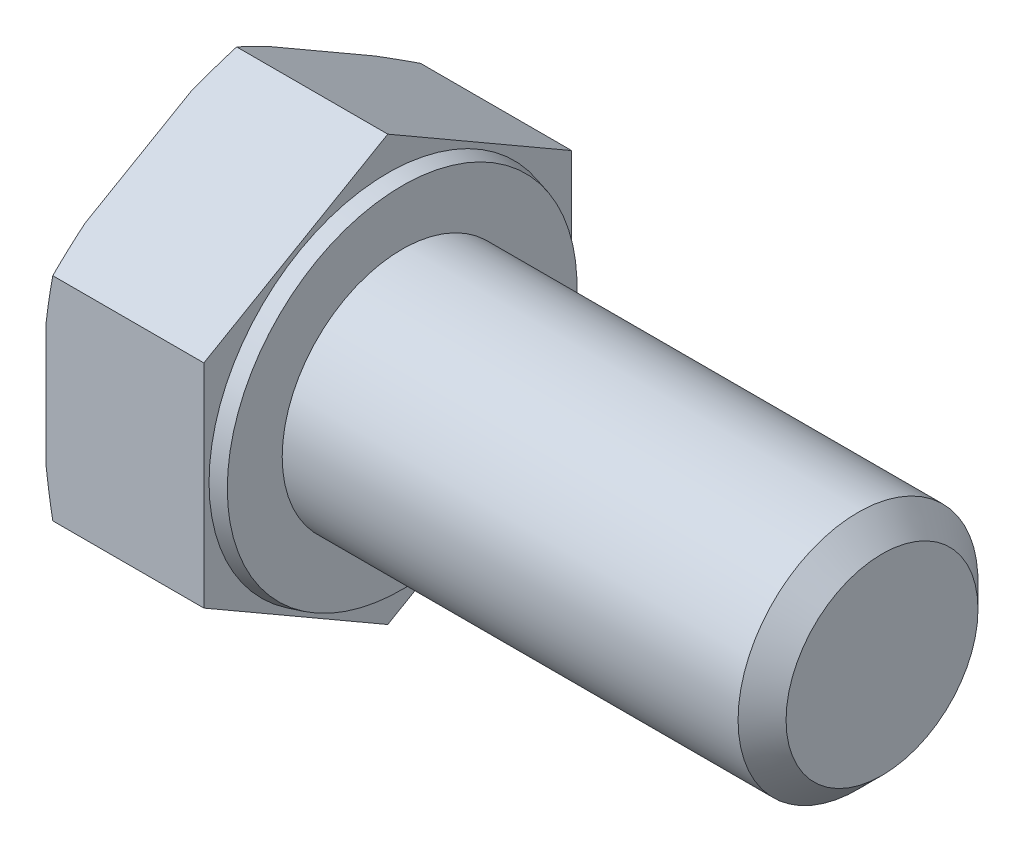
ISO-10303-21;
HEADER;
FILE_DESCRIPTION(('STEP AP214'),'2;1');
FILE_NAME('part.step','',(''),(''),'','','');
FILE_SCHEMA(('AUTOMOTIVE_DESIGN { 1 0 10303 214 1 1 1 1 }'));
ENDSEC;
DATA;
#1=APPLICATION_CONTEXT('core data for automotive mechanical design processes');
#2=APPLICATION_PROTOCOL_DEFINITION('international standard','automotive_design',2000,#1);
#3=PRODUCT_CONTEXT('',#1,'mechanical');
#4=PRODUCT('Part','Part','',(#3));
#5=PRODUCT_RELATED_PRODUCT_CATEGORY('part','',(#4));
#6=PRODUCT_DEFINITION_FORMATION('','',#4);
#7=PRODUCT_DEFINITION_CONTEXT('part definition',#1,'design');
#8=PRODUCT_DEFINITION('design','',#6,#7);
#9=PRODUCT_DEFINITION_SHAPE('','',#8);
#10=(LENGTH_UNIT() NAMED_UNIT(*) SI_UNIT(.MILLI.,.METRE.));
#11=(NAMED_UNIT(*) PLANE_ANGLE_UNIT() SI_UNIT($,.RADIAN.));
#12=(NAMED_UNIT(*) SI_UNIT($,.STERADIAN.) SOLID_ANGLE_UNIT());
#13=UNCERTAINTY_MEASURE_WITH_UNIT(LENGTH_MEASURE(1.E-05),#10,'distance_accuracy_value','');
#14=(GEOMETRIC_REPRESENTATION_CONTEXT(3) GLOBAL_UNCERTAINTY_ASSIGNED_CONTEXT((#13)) GLOBAL_UNIT_ASSIGNED_CONTEXT((#10,
#11,#12)) REPRESENTATION_CONTEXT('',''));
#15=CARTESIAN_POINT('',(0.,0.,0.));
#16=DIRECTION('',(0.,0.,1.));
#17=DIRECTION('',(1.,0.,0.));
#18=AXIS2_PLACEMENT_3D('',#15,#16,#17);
#19=CARTESIAN_POINT('',(20.6,-4.42500000000009,-7.66432482349223));
#20=DIRECTION('',(0.,-0.866025403784442,-0.499999999999995));
#21=DIRECTION('',(0.,0.499999999999995,-0.866025403784442));
#22=AXIS2_PLACEMENT_3D('',#19,#20,#21);
#23=PLANE('',#22);
#24=DIRECTION('',(-1.,0.,0.));
#25=VECTOR('',#24,1.);
#26=CARTESIAN_POINT('',(20.6,-8.85,0.));
#27=LINE('',#26,#25);
#28=CARTESIAN_POINT('',(0.,-8.85,0.));
#29=VERTEX_POINT('',#28);
#30=CARTESIAN_POINT('',(-6.29792306844368,-8.85,0.));
#31=VERTEX_POINT('',#30);
#32=EDGE_CURVE('E157',#29,#31,#27,.T.);
#33=ORIENTED_EDGE('',*,*,#32,.T.);
#34=CARTESIAN_POINT('',(-4.7699615006699,-11.9174022332107,5.3128965151713));
#35=CARTESIAN_POINT('',(-4.83614833570257,-11.8050473190038,5.11829209528478));
#36=CARTESIAN_POINT('',(-4.90167255003095,-11.6925948603644,4.92351872348535));
#37=CARTESIAN_POINT('',(-5.03118559698242,-11.4674663528304,4.53358471020429));
#38=CARTESIAN_POINT('',(-5.09517439305191,-11.3547902986816,4.33842405962226));
#39=CARTESIAN_POINT('',(-5.28456041407139,-11.0163157536771,3.75216895060563));
#40=CARTESIAN_POINT('',(-5.40733223857273,-10.7901468045144,3.3604328395613));
#41=CARTESIAN_POINT('',(-5.64480594732521,-10.3342684187143,2.57082831328319));
#42=CARTESIAN_POINT('',(-5.75941225873481,-10.1045464495324,2.17293819104533));
#43=CARTESIAN_POINT('',(-5.97591685440881,-9.6436033227612,1.37456127607789));
#44=CARTESIAN_POINT('',(-6.07781581130404,-9.41238224520544,0.974074621970502));
#45=CARTESIAN_POINT('',(-6.26134144326315,-8.95638364479248,0.184261877874947));
#46=CARTESIAN_POINT('',(-6.34355573274743,-8.73166601658844,-0.204960471530833));
#47=CARTESIAN_POINT('',(-6.48746045966098,-8.28055127837509,-0.986314118159496));
#48=CARTESIAN_POINT('',(-6.54915189984519,-8.05415425097466,-1.37844527229962));
#49=CARTESIAN_POINT('',(-6.62254434564547,-7.71410474496151,-1.9674282938031));
#50=CARTESIAN_POINT('',(-6.64378861584913,-7.60095958105454,-2.16340146632069));
#51=CARTESIAN_POINT('',(-6.67950592063896,-7.37440457175731,-2.55580625313273));
#52=CARTESIAN_POINT('',(-6.69397933196105,-7.26099474144627,-2.75223784130922));
#53=CARTESIAN_POINT('',(-6.7157765759338,-7.03401139991638,-3.14538452131075));
#54=CARTESIAN_POINT('',(-6.72310096885371,-6.92043790222291,-3.34209958970915));
#55=CARTESIAN_POINT('',(-6.73040192529392,-6.69323186195545,-3.73563199523894));
#56=CARTESIAN_POINT('',(-6.73037853713207,-6.57959931977464,-3.93244933168933));
#57=CARTESIAN_POINT('',(-6.72320871548941,-6.35929562962563,-4.31402651612232));
#58=CARTESIAN_POINT('',(-6.71649505277964,-6.25262090601261,-4.49879255730344));
#59=CARTESIAN_POINT('',(-6.69675463432834,-6.03941600442701,-4.86807427927243));
#60=CARTESIAN_POINT('',(-6.68372760236287,-5.93288583298343,-5.05258994875173));
#61=CARTESIAN_POINT('',(-6.63559663675346,-5.61363013252953,-5.60555704254389));
#62=CARTESIAN_POINT('',(-6.59144268713134,-5.40123548697151,-5.97343535990597));
#63=CARTESIAN_POINT('',(-6.48226269320506,-4.97681311893132,-6.70855646522027));
#64=CARTESIAN_POINT('',(-6.41713860156276,-4.7647919199632,-7.07578795411474));
#65=CARTESIAN_POINT('',(-6.27018625376656,-4.34222339340586,-7.80769811179158));
#66=CARTESIAN_POINT('',(-6.18835790112246,-4.1316760743376,-8.17237676581522));
#67=CARTESIAN_POINT('',(-6.00866271800198,-3.70472589760515,-8.91187616421634));
#68=CARTESIAN_POINT('',(-5.91033992742069,-3.48837165185492,-9.286612710289));
#69=CARTESIAN_POINT('',(-5.70311989656312,-3.05693413716248,-10.0338844060276));
#70=CARTESIAN_POINT('',(-5.59422212603359,-2.84185093252738,-10.4064194443103));
#71=CARTESIAN_POINT('',(-5.36943684134144,-2.41473283183158,-11.1462096955477));
#72=CARTESIAN_POINT('',(-5.25362330968472,-2.2026881429877,-11.5134818701005));
#73=CARTESIAN_POINT('',(-5.07537550670142,-1.88529185166037,-12.0632283728134));
#74=CARTESIAN_POINT('',(-5.01521325258259,-1.77961882394802,-12.2462594258008));
#75=CARTESIAN_POINT('',(-4.89354912869936,-1.56846779942573,-12.6119837283436));
#76=CARTESIAN_POINT('',(-4.83204728425027,-1.462989798971,-12.794676984212));
#77=CARTESIAN_POINT('',(-4.7699615006699,-1.35759776678936,-12.9772213386635));
#78=B_SPLINE_CURVE_WITH_KNOTS('',3,(#34,#35,#36,#37,#38,#39,#40,#41,#42,#43,#44,#45,#46,#47,#48,
#49,#50,#51,#52,#53,#54,#55,#56,#57,#58,#59,#60,#61,#62,#63,#64,#65,#66,#67,#68,#69,#70,#71,#72,
#73,#74,#75,#76,#77),.UNSPECIFIED.,.F.,.F.,(4,2,2,2,2,2,2,2,2,2,2,2,2,2,2,2,2,2,2,2,2,4),(0.,
0.702761730342381,1.40554017472233,2.81157217612387,4.23201032618944,5.65237325710521,
7.02270828812482,8.39297635416767,9.07474696516834,9.75647963740092,10.438158877887,
11.119833635759,11.7601005309412,12.4003954417532,13.6809617128842,14.9676044823533,
16.2542546841745,17.5852978857349,18.9164078632869,20.2352036230902,20.894426976119,
21.553637882061),.UNSPECIFIED.);
#79=CARTESIAN_POINT('',(-6.58000000000003,-7.90869530364146,-1.63038755949604));
#80=VERTEX_POINT('',#79);
#81=EDGE_CURVE('E202',#31,#80,#78,.T.);
#82=ORIENTED_EDGE('',*,*,#81,.T.);
#83=DIRECTION('',(0.,-0.499999999999995,0.866025403784442));
#84=VECTOR('',#83,1.);
#85=CARTESIAN_POINT('',(-6.58,-4.42500000000009,-7.66432482349223));
#86=LINE('',#85,#84);
#87=CARTESIAN_POINT('',(-6.58,-5.36630469635854,-6.03393726399618));
#88=VERTEX_POINT('',#87);
#89=EDGE_CURVE('E212',#88,#80,#86,.T.);
#90=ORIENTED_EDGE('',*,*,#89,.F.);
#91=CARTESIAN_POINT('',(-6.29792306844368,-4.42500000000009,-7.66432482349223));
#92=VERTEX_POINT('',#91);
#93=EDGE_CURVE('E215',#88,#92,#78,.T.);
#94=ORIENTED_EDGE('',*,*,#93,.T.);
#95=DIRECTION('',(-1.,0.,0.));
#96=VECTOR('',#95,1.);
#97=CARTESIAN_POINT('',(20.6,-4.42500000000009,-7.66432482349223));
#98=LINE('',#97,#96);
#99=CARTESIAN_POINT('',(0.,-4.42500000000009,-7.66432482349223));
#100=VERTEX_POINT('',#99);
#101=EDGE_CURVE('E168',#100,#92,#98,.T.);
#102=ORIENTED_EDGE('',*,*,#101,.F.);
#103=DIRECTION('',(0.,-0.499999999999995,0.866025403784442));
#104=VECTOR('',#103,1.);
#105=CARTESIAN_POINT('',(0.,-4.42500000000009,-7.66432482349223));
#106=LINE('',#105,#104);
#107=EDGE_CURVE('E183',#100,#29,#106,.T.);
#108=ORIENTED_EDGE('',*,*,#107,.T.);
#109=EDGE_LOOP('',(#33,#82,#90,#94,#102,#108));
#110=FACE_BOUND('',#109,.T.);
#111=ADVANCED_FACE('F35',(#110),#23,.T.);
#112=CARTESIAN_POINT('',(20.6,4.42499999999993,-7.66432482349232));
#113=DIRECTION('',(0.,0.,-1.));
#114=DIRECTION('',(0.,1.,0.));
#115=AXIS2_PLACEMENT_3D('',#112,#113,#114);
#116=PLANE('',#115);
#117=ORIENTED_EDGE('',*,*,#101,.T.);
#118=CARTESIAN_POINT('',(-5.00864005639831,-9.73789651517145,-7.66432482349217));
#119=CARTESIAN_POINT('',(-5.07003318744064,-9.52322769233334,-7.66432482349218));
#120=CARTESIAN_POINT('',(-5.13071664914256,-9.30835600664128,-7.66432482349218));
#121=CARTESIAN_POINT('',(-5.2504442425723,-8.87815277711283,-7.66432482349218));
#122=CARTESIAN_POINT('',(-5.30948834652955,-8.66282122555281,-7.66432482349219));
#123=CARTESIAN_POINT('',(-5.48387527888684,-8.01589307910885,-7.66432482349219));
#124=CARTESIAN_POINT('',(-5.59642298983084,-7.58353558067021,-7.6643248234922));
#125=CARTESIAN_POINT('',(-5.81266226723173,-6.71259000391773,-7.66432482349221));
#126=CARTESIAN_POINT('',(-5.91626806915323,-6.27398046842187,-7.66432482349221));
#127=CARTESIAN_POINT('',(-6.11029091280608,-5.39384656433909,-7.66432482349222));
#128=CARTESIAN_POINT('',(-6.20070892550878,-4.95232241284974,-7.66432482349222));
#129=CARTESIAN_POINT('',(-6.36160933963008,-4.08051166755351,-7.66432482349223));
#130=CARTESIAN_POINT('',(-6.43264625776086,-3.65032885049375,-7.66432482349224));
#131=CARTESIAN_POINT('',(-6.55428187483288,-2.78707107422335,-7.66432482349225));
#132=CARTESIAN_POINT('',(-6.60488453148917,-2.35399669158535,-7.66432482349225));
#133=CARTESIAN_POINT('',(-6.66240831794471,-1.70368188145931,-7.66432482349226));
#134=CARTESIAN_POINT('',(-6.67850532779577,-1.48723464984804,-7.66432482349226));
#135=CARTESIAN_POINT('',(-6.70429433272965,-1.05396299728827,-7.66432482349227));
#136=CARTESIAN_POINT('',(-6.71398664875919,-0.837138595786226,-7.66432482349227));
#137=CARTESIAN_POINT('',(-6.72672253024382,-0.403302294793051,-7.66432482349227));
#138=CARTESIAN_POINT('',(-6.72976638437883,-0.186290403852155,-7.66432482349227));
#139=CARTESIAN_POINT('',(-6.7291358967764,0.247718950123678,-7.66432482349228));
#140=CARTESIAN_POINT('',(-6.72546155695146,0.464716413162706,-7.66432482349228));
#141=CARTESIAN_POINT('',(-6.70624362970486,1.06036953223341,-7.66432482349229));
#142=CARTESIAN_POINT('',(-6.68388895075078,1.43882252598365,-7.66432482349229));
#143=CARTESIAN_POINT('',(-6.62050559151052,2.19412494594648,-7.6643248234923));
#144=CARTESIAN_POINT('',(-6.57947609181733,2.57097430106276,-7.6643248234923));
#145=CARTESIAN_POINT('',(-6.48113797206862,3.32388976987407,-7.66432482349231));
#146=CARTESIAN_POINT('',(-6.4237712185853,3.69994816672772,-7.66432482349232));
#147=CARTESIAN_POINT('',(-6.2956564145037,4.44978573942378,-7.66432482349232));
#148=CARTESIAN_POINT('',(-6.22490691200718,4.82356466341955,-7.66432482349233));
#149=CARTESIAN_POINT('',(-6.0704014797458,5.58003633732887,-7.66432482349234));
#150=CARTESIAN_POINT('',(-5.98632024183774,5.96266195818458,-7.66432482349234));
#151=CARTESIAN_POINT('',(-5.80919867667365,6.72583533235177,-7.66432482349235));
#152=CARTESIAN_POINT('',(-5.71615790531566,7.10638298167437,-7.66432482349235));
#153=CARTESIAN_POINT('',(-5.52374117974904,7.86297645537245,-7.66432482349236));
#154=CARTESIAN_POINT('',(-5.42441511026811,8.23903503370974,-7.66432482349236));
#155=CARTESIAN_POINT('',(-5.27134102225385,8.80195695976291,-7.66432482349237));
#156=CARTESIAN_POINT('',(-5.21964171692946,8.98938164843282,-7.66432482349237));
#157=CARTESIAN_POINT('',(-5.11502150400523,9.36388780999383,-7.66432482349237));
#158=CARTESIAN_POINT('',(-5.06210060924165,9.55096928646908,-7.66432482349238));
#159=CARTESIAN_POINT('',(-5.00864005639831,9.73789651517129,-7.66432482349238));
#160=B_SPLINE_CURVE_WITH_KNOTS('',3,(#118,#119,#120,#121,#122,#123,#124,#125,#126,#127,#128,
#129,#130,#131,#132,#133,#134,#135,#136,#137,#138,#139,#140,#141,#142,#143,#144,#145,#146,#147,
#148,#149,#150,#151,#152,#153,#154,#155,#156,#157,#158,#159),.UNSPECIFIED.,.F.,.F.,(4,2,2,2,2,2,
2,2,2,2,2,2,2,2,2,2,2,2,2,2,4),(0.,0.669823290546161,1.33965792092904,2.67986595636369,
4.03175825312792,5.38355096443301,6.69120700403605,7.99860965473741,8.64966414612008,
9.300686009923,9.95167960543101,10.6026730156168,11.7394565125237,12.876289893615,
14.0172201663474,15.1582742899967,16.3334026116279,17.5085892114817,18.6753990362947,
19.2586689197893,19.8419326771629),.UNSPECIFIED.);
#161=CARTESIAN_POINT('',(-6.58000000000003,-2.54239060728318,-7.66432482349217));
#162=VERTEX_POINT('',#161);
#163=EDGE_CURVE('E223',#92,#162,#160,.T.);
#164=ORIENTED_EDGE('',*,*,#163,.T.);
#165=DIRECTION('',(0.,-1.,0.));
#166=VECTOR('',#165,1.);
#167=CARTESIAN_POINT('',(-6.58,4.42499999999993,-7.66432482349232));
#168=LINE('',#167,#166);
#169=CARTESIAN_POINT('',(-6.58,2.54239060728305,-7.6643248234923));
#170=VERTEX_POINT('',#169);
#171=EDGE_CURVE('E163',#170,#162,#168,.T.);
#172=ORIENTED_EDGE('',*,*,#171,.F.);
#173=CARTESIAN_POINT('',(-6.29792306844368,4.42499999999993,-7.66432482349232));
#174=VERTEX_POINT('',#173);
#175=EDGE_CURVE('E50',#170,#174,#160,.T.);
#176=ORIENTED_EDGE('',*,*,#175,.T.);
#177=DIRECTION('',(-1.,0.,0.));
#178=VECTOR('',#177,1.);
#179=CARTESIAN_POINT('',(20.6,4.42499999999993,-7.66432482349232));
#180=LINE('',#179,#178);
#181=CARTESIAN_POINT('',(0.,4.42499999999993,-7.66432482349232));
#182=VERTEX_POINT('',#181);
#183=EDGE_CURVE('E154',#182,#174,#180,.T.);
#184=ORIENTED_EDGE('',*,*,#183,.F.);
#185=DIRECTION('',(0.,-1.,0.));
#186=VECTOR('',#185,1.);
#187=CARTESIAN_POINT('',(0.,8.84999999999992,-7.66432482349237));
#188=LINE('',#187,#186);
#189=EDGE_CURVE('E181',#182,#100,#188,.T.);
#190=ORIENTED_EDGE('',*,*,#189,.T.);
#191=EDGE_LOOP('',(#117,#164,#172,#176,#184,#190));
#192=FACE_BOUND('',#191,.T.);
#193=ADVANCED_FACE('F250',(#192),#116,.T.);
#194=CARTESIAN_POINT('',(20.6,8.85,0.));
#195=DIRECTION('',(0.,0.866025403784435,-0.500000000000007));
#196=DIRECTION('',(0.,0.500000000000007,0.866025403784435));
#197=AXIS2_PLACEMENT_3D('',#194,#195,#196);
#198=PLANE('',#197);
#199=ORIENTED_EDGE('',*,*,#183,.T.);
#200=CARTESIAN_POINT('',(-4.76996150066986,1.35759776678906,-12.9772213386637));
#201=CARTESIAN_POINT('',(-4.83614833570253,1.46995268099604,-12.7826169187772));
#202=CARTESIAN_POINT('',(-4.9016725500309,1.58240513963541,-12.5878435469777));
#203=CARTESIAN_POINT('',(-5.03118559698238,1.80753364716942,-12.1979095336967));
#204=CARTESIAN_POINT('',(-5.09517439305187,1.92020970131818,-12.0027488831146));
#205=CARTESIAN_POINT('',(-5.28456041407135,2.25868424632273,-11.416493774098));
#206=CARTESIAN_POINT('',(-5.40733223857269,2.48485319548548,-11.0247576630537));
#207=CARTESIAN_POINT('',(-5.64480594732517,2.94073158128551,-10.2351531367756));
#208=CARTESIAN_POINT('',(-5.75941225873478,3.17045355046743,-9.83726301453771));
#209=CARTESIAN_POINT('',(-5.97591685440879,3.63139667723867,-9.03888609957028));
#210=CARTESIAN_POINT('',(-6.07781581130402,3.86261775479443,-8.63839944546289));
#211=CARTESIAN_POINT('',(-6.26134144326313,4.3186163552074,-7.84858670136733));
#212=CARTESIAN_POINT('',(-6.34355573274742,4.54333398341145,-7.45936435196155));
#213=CARTESIAN_POINT('',(-6.48746045966097,4.99444872162482,-6.67801070533289));
#214=CARTESIAN_POINT('',(-6.54915189984519,5.22084574902526,-6.28587955119277));
#215=CARTESIAN_POINT('',(-6.62254434564547,5.56089525503842,-5.69689652968929));
#216=CARTESIAN_POINT('',(-6.64378861584913,5.6740404189454,-5.5009233571717));
#217=CARTESIAN_POINT('',(-6.67950592063896,5.90059542824263,-5.10851857035966));
#218=CARTESIAN_POINT('',(-6.69397933196106,6.01400525855368,-4.91208698218316));
#219=CARTESIAN_POINT('',(-6.7157765759338,6.24098860008357,-4.51894030218163));
#220=CARTESIAN_POINT('',(-6.72310096885372,6.35456209777704,-4.32222523378324));
#221=CARTESIAN_POINT('',(-6.73040192529394,6.58176813804451,-3.92869282825345));
#222=CARTESIAN_POINT('',(-6.73037853713208,6.69540068022533,-3.73187549180306));
#223=CARTESIAN_POINT('',(-6.72320871548943,6.91570437037435,-3.35029830737006));
#224=CARTESIAN_POINT('',(-6.71649505277966,7.02237909398738,-3.16553226618893));
#225=CARTESIAN_POINT('',(-6.69675463432836,7.23558399557298,-2.79625054421994));
#226=CARTESIAN_POINT('',(-6.68372760236289,7.34211416701656,-2.61173487474064));
#227=CARTESIAN_POINT('',(-6.63559663675348,7.66136986747048,-2.05876778094847));
#228=CARTESIAN_POINT('',(-6.59144268713136,7.87376451302852,-1.69088946358639));
#229=CARTESIAN_POINT('',(-6.48226269320508,8.29818688106872,-0.955768358272066));
#230=CARTESIAN_POINT('',(-6.41713860156277,8.51020808003686,-0.588536869377594));
#231=CARTESIAN_POINT('',(-6.27018625376657,8.93277660659422,0.143373288299261));
#232=CARTESIAN_POINT('',(-6.18835790112246,9.14332392566248,0.508051942322905));
#233=CARTESIAN_POINT('',(-6.00866271800198,9.57027410239495,1.24755134072404));
#234=CARTESIAN_POINT('',(-5.91033992742068,9.7866283481452,1.62228788679671));
#235=CARTESIAN_POINT('',(-5.7031198965631,10.2180658628377,2.36955958253527));
#236=CARTESIAN_POINT('',(-5.59422212603357,10.4331490674728,2.74209462081801));
#237=CARTESIAN_POINT('',(-5.36943684134141,10.8602671681686,3.48188487205548));
#238=CARTESIAN_POINT('',(-5.25362330968469,11.0723118570125,3.84915704660822));
#239=CARTESIAN_POINT('',(-5.07537550670138,11.3897081483398,4.39890354932111));
#240=CARTESIAN_POINT('',(-5.01521325258256,11.4953811760522,4.58193460230855));
#241=CARTESIAN_POINT('',(-4.89354912869932,11.7065322005745,4.94765890485139));
#242=CARTESIAN_POINT('',(-4.83204728425022,11.8120102010292,5.13035216071975));
#243=CARTESIAN_POINT('',(-4.76996150066986,11.9174022332109,5.3128965151713));
#244=B_SPLINE_CURVE_WITH_KNOTS('',3,(#200,#201,#202,#203,#204,#205,#206,#207,#208,#209,#210,
#211,#212,#213,#214,#215,#216,#217,#218,#219,#220,#221,#222,#223,#224,#225,#226,#227,#228,#229,
#230,#231,#232,#233,#234,#235,#236,#237,#238,#239,#240,#241,#242,#243),.UNSPECIFIED.,.F.,.F.,(4,
2,2,2,2,2,2,2,2,2,2,2,2,2,2,2,2,2,2,2,2,4),(0.,0.702761730342386,1.40554017472235,
2.8115721761239,4.23201032618948,5.65237325710526,7.02270828812488,8.39297635416775,
9.07474696516843,9.75647963740101,10.4381588778871,11.1198336357591,11.7601005309413,
12.4003954417533,13.6809617128843,14.9676044823535,16.2542546841748,17.5852978857351,
18.9164078632872,20.2352036230905,20.8944269761194,21.5536378820613),.UNSPECIFIED.);
#245=CARTESIAN_POINT('',(-6.58000000000003,5.36630469635833,-6.03393726399625));
#246=VERTEX_POINT('',#245);
#247=EDGE_CURVE('E245',#174,#246,#244,.T.);
#248=ORIENTED_EDGE('',*,*,#247,.T.);
#249=DIRECTION('',(0.,-0.500000000000007,-0.866025403784435));
#250=VECTOR('',#249,1.);
#251=CARTESIAN_POINT('',(-6.58,8.85,0.));
#252=LINE('',#251,#250);
#253=CARTESIAN_POINT('',(-6.58,7.90869530364155,-1.63038755949607));
#254=VERTEX_POINT('',#253);
#255=EDGE_CURVE('E235',#254,#246,#252,.T.);
#256=ORIENTED_EDGE('',*,*,#255,.F.);
#257=CARTESIAN_POINT('',(-6.29792306844368,8.85,0.));
#258=VERTEX_POINT('',#257);
#259=EDGE_CURVE('E58',#254,#258,#244,.T.);
#260=ORIENTED_EDGE('',*,*,#259,.T.);
#261=DIRECTION('',(-1.,0.,0.));
#262=VECTOR('',#261,1.);
#263=CARTESIAN_POINT('',(20.6,8.85,0.));
#264=LINE('',#263,#262);
#265=CARTESIAN_POINT('',(0.,8.85,0.));
#266=VERTEX_POINT('',#265);
#267=EDGE_CURVE('E151',#266,#258,#264,.T.);
#268=ORIENTED_EDGE('',*,*,#267,.F.);
#269=DIRECTION('',(0.,-0.500000000000007,-0.866025403784435));
#270=VECTOR('',#269,1.);
#271=CARTESIAN_POINT('',(0.,8.85000000000003,0.));
#272=LINE('',#271,#270);
#273=EDGE_CURVE('E179',#266,#182,#272,.T.);
#274=ORIENTED_EDGE('',*,*,#273,.T.);
#275=EDGE_LOOP('',(#199,#248,#256,#260,#268,#274));
#276=FACE_BOUND('',#275,.T.);
#277=ADVANCED_FACE('F243',(#276),#198,.T.);
#278=CARTESIAN_POINT('',(20.6,4.42500000000004,7.66432482349226));
#279=DIRECTION('',(0.,0.866025403784442,0.499999999999995));
#280=DIRECTION('',(0.,-0.499999999999995,0.866025403784442));
#281=AXIS2_PLACEMENT_3D('',#278,#279,#280);
#282=PLANE('',#281);
#283=ORIENTED_EDGE('',*,*,#267,.T.);
#284=CARTESIAN_POINT('',(-4.76996150066987,11.9174022332108,-5.31289651517142));
#285=CARTESIAN_POINT('',(-4.83614833570254,11.8050473190038,-5.1182920952849));
#286=CARTESIAN_POINT('',(-4.90167255003092,11.6925948603644,-4.92351872348547));
#287=CARTESIAN_POINT('',(-5.03118559698239,11.4674663528304,-4.53358471020441));
#288=CARTESIAN_POINT('',(-5.09517439305188,11.3547902986817,-4.33842405962238));
#289=CARTESIAN_POINT('',(-5.28456041407136,11.0163157536771,-3.75216895060575));
#290=CARTESIAN_POINT('',(-5.40733223857271,10.7901468045144,-3.36043283956141));
#291=CARTESIAN_POINT('',(-5.64480594732519,10.3342684187144,-2.57082831328329));
#292=CARTESIAN_POINT('',(-5.75941225873479,10.1045464495324,-2.17293819104543));
#293=CARTESIAN_POINT('',(-5.9759168544088,9.64360332276122,-1.374561276078));
#294=CARTESIAN_POINT('',(-6.07781581130403,9.41238224520547,-0.974074621970603));
#295=CARTESIAN_POINT('',(-6.26134144326314,8.9563836447925,-0.184261877875044));
#296=CARTESIAN_POINT('',(-6.34355573274742,8.73166601658846,0.204960471530738));
#297=CARTESIAN_POINT('',(-6.48746045966097,8.28055127837511,0.986314118159405));
#298=CARTESIAN_POINT('',(-6.54915189984519,8.05415425097468,1.37844527229953));
#299=CARTESIAN_POINT('',(-6.62254434564547,7.71410474496152,1.96742829380302));
#300=CARTESIAN_POINT('',(-6.64378861584914,7.60095958105455,2.16340146632061));
#301=CARTESIAN_POINT('',(-6.67950592063896,7.37440457175732,2.55580625313265));
#302=CARTESIAN_POINT('',(-6.69397933196106,7.26099474144628,2.75223784130914));
#303=CARTESIAN_POINT('',(-6.7157765759338,7.03401139991639,3.14538452131068));
#304=CARTESIAN_POINT('',(-6.72310096885372,6.92043790222292,3.34209958970907));
#305=CARTESIAN_POINT('',(-6.73040192529394,6.69323186195546,3.73563199523886));
#306=CARTESIAN_POINT('',(-6.73037853713208,6.57959931977464,3.93244933168925));
#307=CARTESIAN_POINT('',(-6.72320871548943,6.35929562962563,4.31402651612225));
#308=CARTESIAN_POINT('',(-6.71649505277965,6.25262090601261,4.49879255730338));
#309=CARTESIAN_POINT('',(-6.69675463432836,6.03941600442701,4.86807427927237));
#310=CARTESIAN_POINT('',(-6.68372760236289,5.93288583298343,5.05258994875167));
#311=CARTESIAN_POINT('',(-6.63559663675348,5.61363013252952,5.60555704254384));
#312=CARTESIAN_POINT('',(-6.59144268713136,5.40123548697149,5.97343535990593));
#313=CARTESIAN_POINT('',(-6.48226269320508,4.9768131189313,6.70855646522025));
#314=CARTESIAN_POINT('',(-6.41713860156277,4.76479191996317,7.07578795411472));
#315=CARTESIAN_POINT('',(-6.27018625376657,4.34222339340582,7.80769811179158));
#316=CARTESIAN_POINT('',(-6.18835790112247,4.13167607433756,8.17237676581522));
#317=CARTESIAN_POINT('',(-6.00866271800198,3.70472589760511,8.91187616421636));
#318=CARTESIAN_POINT('',(-5.91033992742068,3.48837165185487,9.28661271028903));
#319=CARTESIAN_POINT('',(-5.70311989656311,3.05693413716242,10.0338844060276));
#320=CARTESIAN_POINT('',(-5.59422212603358,2.84185093252732,10.4064194443103));
#321=CARTESIAN_POINT('',(-5.36943684134142,2.41473283183151,11.1462096955478));
#322=CARTESIAN_POINT('',(-5.2536233096847,2.20268814298763,11.5134818701005));
#323=CARTESIAN_POINT('',(-5.07537550670139,1.88529185166029,12.0632283728134));
#324=CARTESIAN_POINT('',(-5.01521325258257,1.77961882394793,12.2462594258009));
#325=CARTESIAN_POINT('',(-4.89354912869933,1.56846779942564,12.6119837283437));
#326=CARTESIAN_POINT('',(-4.83204728425023,1.46298979897091,12.7946769842121));
#327=CARTESIAN_POINT('',(-4.76996150066987,1.35759776678926,12.9772213386636));
#328=B_SPLINE_CURVE_WITH_KNOTS('',3,(#284,#285,#286,#287,#288,#289,#290,#291,#292,#293,#294,
#295,#296,#297,#298,#299,#300,#301,#302,#303,#304,#305,#306,#307,#308,#309,#310,#311,#312,#313,
#314,#315,#316,#317,#318,#319,#320,#321,#322,#323,#324,#325,#326,#327),.UNSPECIFIED.,.F.,.F.,(4,
2,2,2,2,2,2,2,2,2,2,2,2,2,2,2,2,2,2,2,2,4),(0.,0.702761730342387,1.40554017472234,
2.81157217612389,4.23201032618947,5.65237325710524,7.02270828812486,8.39297635416772,
9.0747469651684,9.75647963740098,10.4381588778871,11.119833635759,11.7601005309412,
12.4003954417533,13.6809617128843,14.9676044823535,16.2542546841747,17.5852978857351,
18.9164078632871,20.2352036230904,20.8944269761193,21.5536378820613),.UNSPECIFIED.);
#329=CARTESIAN_POINT('',(-6.58000000000003,7.90869530364148,1.63038755949594));
#330=VERTEX_POINT('',#329);
#331=EDGE_CURVE('E145',#258,#330,#328,.T.);
#332=ORIENTED_EDGE('',*,*,#331,.T.);
#333=DIRECTION('',(0.,0.499999999999995,-0.866025403784442));
#334=VECTOR('',#333,1.);
#335=CARTESIAN_POINT('',(-6.58,4.42500000000004,7.66432482349226));
#336=LINE('',#335,#334);
#337=CARTESIAN_POINT('',(-6.58,5.36630469635847,6.03393726399624));
#338=VERTEX_POINT('',#337);
#339=EDGE_CURVE('E144',#338,#330,#336,.T.);
#340=ORIENTED_EDGE('',*,*,#339,.F.);
#341=CARTESIAN_POINT('',(-6.29792306844368,4.42500000000004,7.66432482349226));
#342=VERTEX_POINT('',#341);
#343=EDGE_CURVE('E126',#338,#342,#328,.T.);
#344=ORIENTED_EDGE('',*,*,#343,.T.);
#345=DIRECTION('',(-1.,0.,0.));
#346=VECTOR('',#345,1.);
#347=CARTESIAN_POINT('',(20.6,4.42500000000004,7.66432482349226));
#348=LINE('',#347,#346);
#349=CARTESIAN_POINT('',(0.,4.42500000000004,7.66432482349226));
#350=VERTEX_POINT('',#349);
#351=EDGE_CURVE('E140',#350,#342,#348,.T.);
#352=ORIENTED_EDGE('',*,*,#351,.F.);
#353=DIRECTION('',(0.,0.499999999999995,-0.866025403784442));
#354=VECTOR('',#353,1.);
#355=CARTESIAN_POINT('',(0.,8.84999999999997,0.));
#356=LINE('',#355,#354);
#357=EDGE_CURVE('E177',#350,#266,#356,.T.);
#358=ORIENTED_EDGE('',*,*,#357,.T.);
#359=EDGE_LOOP('',(#283,#332,#340,#344,#352,#358));
#360=FACE_BOUND('',#359,.T.);
#361=ADVANCED_FACE('F139',(#360),#282,.T.);
#362=CARTESIAN_POINT('',(20.6,-4.42499999999998,7.66432482349229));
#363=DIRECTION('',(0.,0.,1.));
#364=DIRECTION('',(0.,-1.,0.));
#365=AXIS2_PLACEMENT_3D('',#362,#363,#364);
#366=PLANE('',#365);
#367=ORIENTED_EDGE('',*,*,#351,.T.);
#368=CARTESIAN_POINT('',(-5.00864005639831,9.7378965151714,7.66432482349224));
#369=CARTESIAN_POINT('',(-5.07003318744064,9.52322769233328,7.66432482349224));
#370=CARTESIAN_POINT('',(-5.13071664914256,9.30835600664122,7.66432482349224));
#371=CARTESIAN_POINT('',(-5.2504442425723,8.87815277711278,7.66432482349225));
#372=CARTESIAN_POINT('',(-5.30948834652955,8.66282122555276,7.66432482349225));
#373=CARTESIAN_POINT('',(-5.48387527888684,8.0158930791088,7.66432482349225));
#374=CARTESIAN_POINT('',(-5.59642298983084,7.58353558067016,7.66432482349225));
#375=CARTESIAN_POINT('',(-5.81266226723173,6.71259000391768,7.66432482349225));
#376=CARTESIAN_POINT('',(-5.91626806915323,6.27398046842182,7.66432482349225));
#377=CARTESIAN_POINT('',(-6.11029091280608,5.39384656433903,7.66432482349226));
#378=CARTESIAN_POINT('',(-6.20070892550878,4.95232241284969,7.66432482349226));
#379=CARTESIAN_POINT('',(-6.36160933963008,4.08051166755345,7.66432482349226));
#380=CARTESIAN_POINT('',(-6.43264625776087,3.6503288504937,7.66432482349226));
#381=CARTESIAN_POINT('',(-6.55428187483288,2.7870710742233,7.66432482349227));
#382=CARTESIAN_POINT('',(-6.60488453148917,2.3539966915853,7.66432482349227));
#383=CARTESIAN_POINT('',(-6.66240831794471,1.70368188145926,7.66432482349227));
#384=CARTESIAN_POINT('',(-6.67850532779577,1.48723464984798,7.66432482349227));
#385=CARTESIAN_POINT('',(-6.70429433272965,1.05396299728821,7.66432482349227));
#386=CARTESIAN_POINT('',(-6.71398664875919,0.83713859578617,7.66432482349227));
#387=CARTESIAN_POINT('',(-6.72672253024382,0.403302294792995,7.66432482349227));
#388=CARTESIAN_POINT('',(-6.72976638437883,0.1862904038521,7.66432482349228));
#389=CARTESIAN_POINT('',(-6.7291358967764,-0.247718950123733,7.66432482349228));
#390=CARTESIAN_POINT('',(-6.72546155695146,-0.46471641316276,7.66432482349228));
#391=CARTESIAN_POINT('',(-6.70624362970486,-1.06036953223346,7.66432482349228));
#392=CARTESIAN_POINT('',(-6.68388895075078,-1.43882252598371,7.66432482349228));
#393=CARTESIAN_POINT('',(-6.62050559151052,-2.19412494594653,7.66432482349228));
#394=CARTESIAN_POINT('',(-6.57947609181733,-2.57097430106281,7.66432482349229));
#395=CARTESIAN_POINT('',(-6.48113797206862,-3.32388976987413,7.66432482349229));
#396=CARTESIAN_POINT('',(-6.4237712185853,-3.69994816672777,7.66432482349229));
#397=CARTESIAN_POINT('',(-6.2956564145037,-4.44978573942384,7.66432482349229));
#398=CARTESIAN_POINT('',(-6.22490691200718,-4.8235646634196,7.66432482349229));
#399=CARTESIAN_POINT('',(-6.0704014797458,-5.58003633732892,7.6643248234923));
#400=CARTESIAN_POINT('',(-5.98632024183774,-5.96266195818463,7.6643248234923));
#401=CARTESIAN_POINT('',(-5.80919867667365,-6.72583533235183,7.6643248234923));
#402=CARTESIAN_POINT('',(-5.71615790531566,-7.10638298167442,7.6643248234923));
#403=CARTESIAN_POINT('',(-5.52374117974904,-7.8629764553725,7.66432482349231));
#404=CARTESIAN_POINT('',(-5.42441511026811,-8.2390350337098,7.66432482349231));
#405=CARTESIAN_POINT('',(-5.27134102225385,-8.80195695976297,7.66432482349231));
#406=CARTESIAN_POINT('',(-5.21964171692946,-8.98938164843288,7.66432482349231));
#407=CARTESIAN_POINT('',(-5.11502150400523,-9.36388780999389,7.66432482349231));
#408=CARTESIAN_POINT('',(-5.06210060924165,-9.55096928646914,7.66432482349231));
#409=CARTESIAN_POINT('',(-5.00864005639831,-9.73789651517135,7.66432482349231));
#410=B_SPLINE_CURVE_WITH_KNOTS('',3,(#368,#369,#370,#371,#372,#373,#374,#375,#376,#377,#378,
#379,#380,#381,#382,#383,#384,#385,#386,#387,#388,#389,#390,#391,#392,#393,#394,#395,#396,#397,
#398,#399,#400,#401,#402,#403,#404,#405,#406,#407,#408,#409),.UNSPECIFIED.,.F.,.F.,(4,2,2,2,2,2,
2,2,2,2,2,2,2,2,2,2,2,2,2,2,4),(0.,0.669823290546161,1.33965792092904,2.67986595636369,
4.03175825312792,5.38355096443301,6.69120700403605,7.99860965473742,8.64966414612009,
9.300686009923,9.95167960543102,10.6026730156168,11.7394565125237,12.876289893615,
14.0172201663474,15.1582742899967,16.3334026116279,17.5085892114817,18.6753990362947,
19.2586689197893,19.8419326771629),.UNSPECIFIED.);
#411=CARTESIAN_POINT('',(-6.58000000000003,2.54239060728313,7.66432482349219));
#412=VERTEX_POINT('',#411);
#413=EDGE_CURVE('E123',#342,#412,#410,.T.);
#414=ORIENTED_EDGE('',*,*,#413,.T.);
#415=DIRECTION('',(0.,1.,0.));
#416=VECTOR('',#415,1.);
#417=CARTESIAN_POINT('',(-6.58,-4.42499999999998,7.66432482349229));
#418=LINE('',#417,#416);
#419=CARTESIAN_POINT('',(-6.58,-2.5423906072831,7.66432482349229));
#420=VERTEX_POINT('',#419);
#421=EDGE_CURVE('E221',#420,#412,#418,.T.);
#422=ORIENTED_EDGE('',*,*,#421,.F.);
#423=CARTESIAN_POINT('',(-6.29792306844368,-4.42499999999998,7.66432482349229));
#424=VERTEX_POINT('',#423);
#425=EDGE_CURVE('E133',#420,#424,#410,.T.);
#426=ORIENTED_EDGE('',*,*,#425,.T.);
#427=DIRECTION('',(-1.,0.,0.));
#428=VECTOR('',#427,1.);
#429=CARTESIAN_POINT('',(20.6,-4.42499999999998,7.66432482349229));
#430=LINE('',#429,#428);
#431=CARTESIAN_POINT('',(0.,-4.42499999999998,7.66432482349229));
#432=VERTEX_POINT('',#431);
#433=EDGE_CURVE('E152',#432,#424,#430,.T.);
#434=ORIENTED_EDGE('',*,*,#433,.F.);
#435=DIRECTION('',(0.,1.,0.));
#436=VECTOR('',#435,1.);
#437=CARTESIAN_POINT('',(0.,8.85000000000003,7.66432482349225));
#438=LINE('',#437,#436);
#439=EDGE_CURVE('E150',#432,#350,#438,.T.);
#440=ORIENTED_EDGE('',*,*,#439,.T.);
#441=EDGE_LOOP('',(#367,#414,#422,#426,#434,#440));
#442=FACE_BOUND('',#441,.T.);
#443=ADVANCED_FACE('F147',(#442),#366,.T.);
#444=CARTESIAN_POINT('',(20.6,-8.85,0.));
#445=DIRECTION('',(0.,-0.866025403784438,0.500000000000001));
#446=DIRECTION('',(0.,-0.500000000000001,-0.866025403784438));
#447=AXIS2_PLACEMENT_3D('',#444,#445,#446);
#448=PLANE('',#447);
#449=ORIENTED_EDGE('',*,*,#433,.T.);
#450=CARTESIAN_POINT('',(-4.76996150066987,-1.35759776678916,12.9772213386637));
#451=CARTESIAN_POINT('',(-4.83614833570253,-1.46995268099614,12.7826169187771));
#452=CARTESIAN_POINT('',(-4.90167255003091,-1.58240513963551,12.5878435469777));
#453=CARTESIAN_POINT('',(-5.03118559698239,-1.80753364716952,12.1979095336966));
#454=CARTESIAN_POINT('',(-5.09517439305187,-1.92020970131828,12.0027488831146));
#455=CARTESIAN_POINT('',(-5.28456041407135,-2.25868424632282,11.416493774098));
#456=CARTESIAN_POINT('',(-5.4073322385727,-2.48485319548557,11.0247576630537));
#457=CARTESIAN_POINT('',(-5.64480594732518,-2.94073158128559,10.2351531367755));
#458=CARTESIAN_POINT('',(-5.75941225873479,-3.17045355046751,9.83726301453767));
#459=CARTESIAN_POINT('',(-5.97591685440879,-3.63139667723874,9.03888609957024));
#460=CARTESIAN_POINT('',(-6.07781581130402,-3.8626177547945,8.63839944546285));
#461=CARTESIAN_POINT('',(-6.26134144326314,-4.31861635520747,7.84858670136729));
#462=CARTESIAN_POINT('',(-6.34355573274742,-4.54333398341151,7.45936435196151));
#463=CARTESIAN_POINT('',(-6.48746045966097,-4.99444872162487,6.67801070533285));
#464=CARTESIAN_POINT('',(-6.54915189984519,-5.22084574902531,6.28587955119272));
#465=CARTESIAN_POINT('',(-6.62254434564547,-5.56089525503846,5.69689652968924));
#466=CARTESIAN_POINT('',(-6.64378861584913,-5.67404041894544,5.50092335717165));
#467=CARTESIAN_POINT('',(-6.67950592063896,-5.90059542824267,5.10851857035961));
#468=CARTESIAN_POINT('',(-6.69397933196106,-6.01400525855372,4.91208698218311));
#469=CARTESIAN_POINT('',(-6.7157765759338,-6.24098860008361,4.51894030218158));
#470=CARTESIAN_POINT('',(-6.72310096885372,-6.35456209777708,4.32222523378318));
#471=CARTESIAN_POINT('',(-6.73040192529394,-6.58176813804454,3.92869282825339));
#472=CARTESIAN_POINT('',(-6.73037853713208,-6.69540068022536,3.73187549180301));
#473=CARTESIAN_POINT('',(-6.72320871548943,-6.91570437037438,3.35029830737));
#474=CARTESIAN_POINT('',(-6.71649505277966,-7.0223790939874,3.16553226618888));
#475=CARTESIAN_POINT('',(-6.69675463432836,-7.23558399557301,2.79625054421989));
#476=CARTESIAN_POINT('',(-6.68372760236289,-7.34211416701659,2.61173487474059));
#477=CARTESIAN_POINT('',(-6.63559663675348,-7.6613698674705,2.05876778094842));
#478=CARTESIAN_POINT('',(-6.59144268713136,-7.87376451302853,1.69088946358633));
#479=CARTESIAN_POINT('',(-6.48226269320508,-8.29818688106873,0.955768358272009));
#480=CARTESIAN_POINT('',(-6.41713860156277,-8.51020808003686,0.588536869377536));
#481=CARTESIAN_POINT('',(-6.27018625376657,-8.93277660659422,-0.14337328829932));
#482=CARTESIAN_POINT('',(-6.18835790112247,-9.14332392566248,-0.508051942322964));
#483=CARTESIAN_POINT('',(-6.00866271800198,-9.57027410239494,-1.2475513407241));
#484=CARTESIAN_POINT('',(-5.91033992742068,-9.78662834814519,-1.62228788679677));
#485=CARTESIAN_POINT('',(-5.7031198965631,-10.2180658628376,-2.36955958253534));
#486=CARTESIAN_POINT('',(-5.59422212603357,-10.4331490674727,-2.74209462081808));
#487=CARTESIAN_POINT('',(-5.36943684134142,-10.8602671681686,-3.48188487205554));
#488=CARTESIAN_POINT('',(-5.25362330968469,-11.0723118570124,-3.84915704660829));
#489=CARTESIAN_POINT('',(-5.07537550670139,-11.3897081483398,-4.39890354932117));
#490=CARTESIAN_POINT('',(-5.01521325258256,-11.4953811760521,-4.58193460230861));
#491=CARTESIAN_POINT('',(-4.89354912869932,-11.7065322005744,-4.94765890485145));
#492=CARTESIAN_POINT('',(-4.83204728425023,-11.8120102010292,-5.13035216071981));
#493=CARTESIAN_POINT('',(-4.76996150066987,-11.9174022332108,-5.31289651517136));
#494=B_SPLINE_CURVE_WITH_KNOTS('',3,(#450,#451,#452,#453,#454,#455,#456,#457,#458,#459,#460,
#461,#462,#463,#464,#465,#466,#467,#468,#469,#470,#471,#472,#473,#474,#475,#476,#477,#478,#479,
#480,#481,#482,#483,#484,#485,#486,#487,#488,#489,#490,#491,#492,#493),.UNSPECIFIED.,.F.,.F.,(4,
2,2,2,2,2,2,2,2,2,2,2,2,2,2,2,2,2,2,2,2,4),(0.,0.702761730342388,1.40554017472235,
2.81157217612389,4.23201032618948,5.65237325710525,7.02270828812487,8.39297635416773,
9.07474696516841,9.756479637401,10.4381588778871,11.1198336357591,11.7601005309413,
12.4003954417533,13.6809617128843,14.9676044823535,16.2542546841747,17.5852978857351,
18.9164078632871,20.2352036230905,20.8944269761193,21.5536378820613),.UNSPECIFIED.);
#495=CARTESIAN_POINT('',(-6.58000000000003,-5.36630469635837,6.03393726399621));
#496=VERTEX_POINT('',#495);
#497=EDGE_CURVE('E213',#424,#496,#494,.T.);
#498=ORIENTED_EDGE('',*,*,#497,.T.);
#499=DIRECTION('',(0.,0.500000000000001,0.866025403784438));
#500=VECTOR('',#499,1.);
#501=CARTESIAN_POINT('',(-6.58,-8.85,0.));
#502=LINE('',#501,#500);
#503=CARTESIAN_POINT('',(-6.58,-7.90869530364156,1.63038755949602));
#504=VERTEX_POINT('',#503);
#505=EDGE_CURVE('E219',#504,#496,#502,.T.);
#506=ORIENTED_EDGE('',*,*,#505,.F.);
#507=EDGE_CURVE('E204',#504,#31,#494,.T.);
#508=ORIENTED_EDGE('',*,*,#507,.T.);
#509=ORIENTED_EDGE('',*,*,#32,.F.);
#510=DIRECTION('',(0.,0.500000000000001,0.866025403784438));
#511=VECTOR('',#510,1.);
#512=CARTESIAN_POINT('',(0.,-4.42499999999998,7.66432482349229));
#513=LINE('',#512,#511);
#514=EDGE_CURVE('E174',#29,#432,#513,.T.);
#515=ORIENTED_EDGE('',*,*,#514,.T.);
#516=EDGE_LOOP('',(#449,#498,#506,#508,#509,#515));
#517=FACE_BOUND('',#516,.T.);
#518=ADVANCED_FACE('F271',(#517),#448,.T.);
#519=CARTESIAN_POINT('',(-6.58,0.,0.));
#520=DIRECTION('',(1.,0.,0.));
#521=DIRECTION('',(0.,0.,-1.));
#522=AXIS2_PLACEMENT_3D('',#519,#520,#521);
#523=PLANE('',#522);
#524=CARTESIAN_POINT('',(-6.58,0.,0.));
#525=DIRECTION('',(1.,0.,0.));
#526=DIRECTION('',(0.,0.,-1.));
#527=AXIS2_PLACEMENT_3D('',#524,#525,#526);
#528=CIRCLE('',#527,8.07500000000009);
#529=EDGE_CURVE('E188',#170,#246,#528,.T.);
#530=ORIENTED_EDGE('',*,*,#529,.F.);
#531=ORIENTED_EDGE('',*,*,#171,.T.);
#532=EDGE_CURVE('E186',#88,#162,#528,.T.);
#533=ORIENTED_EDGE('',*,*,#532,.F.);
#534=ORIENTED_EDGE('',*,*,#89,.T.);
#535=EDGE_CURVE('E187',#504,#80,#528,.T.);
#536=ORIENTED_EDGE('',*,*,#535,.F.);
#537=ORIENTED_EDGE('',*,*,#505,.T.);
#538=EDGE_CURVE('E194',#420,#496,#528,.T.);
#539=ORIENTED_EDGE('',*,*,#538,.F.);
#540=ORIENTED_EDGE('',*,*,#421,.T.);
#541=CARTESIAN_POINT('',(-6.58000000000003,0.,0.));
#542=DIRECTION('',(-1.,0.,0.));
#543=DIRECTION('',(0.,0.,1.));
#544=AXIS2_PLACEMENT_3D('',#541,#542,#543);
#545=CIRCLE('',#544,8.075);
#546=EDGE_CURVE('E128',#412,#338,#545,.T.);
#547=ORIENTED_EDGE('',*,*,#546,.T.);
#548=ORIENTED_EDGE('',*,*,#339,.T.);
#549=EDGE_CURVE('E192',#254,#330,#528,.T.);
#550=ORIENTED_EDGE('',*,*,#549,.F.);
#551=ORIENTED_EDGE('',*,*,#255,.T.);
#552=EDGE_LOOP('',(#530,#531,#533,#534,#536,#537,#539,#540,#547,#548,#550,#551));
#553=FACE_BOUND('',#552,.T.);
#554=ADVANCED_FACE('F217',(#553),#523,.F.);
#555=CARTESIAN_POINT('',(0.,8.85,0.));
#556=DIRECTION('',(-1.,0.,0.));
#557=DIRECTION('',(0.,0.,1.));
#558=AXIS2_PLACEMENT_3D('',#555,#556,#557);
#559=PLANE('',#558);
#560=CARTESIAN_POINT('',(0.,0.,0.));
#561=DIRECTION('',(-1.,0.,0.));
#562=DIRECTION('',(0.,0.,1.));
#563=AXIS2_PLACEMENT_3D('',#560,#561,#562);
#564=CIRCLE('',#563,7.44897459621555);
#565=CARTESIAN_POINT('',(0.,0.,7.44897459621555));
#566=VERTEX_POINT('',#565);
#567=EDGE_CURVE('E171',#566,#566,#564,.T.);
#568=ORIENTED_EDGE('',*,*,#567,.T.);
#569=EDGE_LOOP('',(#568));
#570=FACE_BOUND('',#569,.T.);
#571=ORIENTED_EDGE('',*,*,#107,.F.);
#572=ORIENTED_EDGE('',*,*,#189,.F.);
#573=ORIENTED_EDGE('',*,*,#273,.F.);
#574=ORIENTED_EDGE('',*,*,#357,.F.);
#575=ORIENTED_EDGE('',*,*,#439,.F.);
#576=ORIENTED_EDGE('',*,*,#514,.F.);
#577=EDGE_LOOP('',(#571,#572,#573,#574,#575,#576));
#578=FACE_BOUND('',#577,.T.);
#579=ADVANCED_FACE('F255',(#570,#578),#559,.F.);
#580=CARTESIAN_POINT('',(0.599999999999934,0.,0.));
#581=DIRECTION('',(-1.,0.,0.));
#582=DIRECTION('',(0.,0.,1.));
#583=AXIS2_PLACEMENT_3D('',#580,#581,#582);
#584=CONICAL_SURFACE('',#583,7.28820508075687,0.261799387799175);
#585=ORIENTED_EDGE('',*,*,#567,.F.);
#586=EDGE_LOOP('',(#585));
#587=FACE_BOUND('',#586,.T.);
#588=CARTESIAN_POINT('',(0.599999999999934,0.,0.));
#589=DIRECTION('',(-1.,0.,0.));
#590=DIRECTION('',(0.,0.,1.));
#591=AXIS2_PLACEMENT_3D('',#588,#589,#590);
#592=CIRCLE('',#591,7.28820508075687);
#593=CARTESIAN_POINT('',(0.599999999999934,0.,7.28820508075687));
#594=VERTEX_POINT('',#593);
#595=EDGE_CURVE('E167',#594,#594,#592,.T.);
#596=ORIENTED_EDGE('',*,*,#595,.T.);
#597=EDGE_LOOP('',(#596));
#598=FACE_BOUND('',#597,.T.);
#599=ADVANCED_FACE('F324',(#587,#598),#584,.T.);
#600=CARTESIAN_POINT('',(0.6,7.28820508075687,0.));
#601=DIRECTION('',(-1.,0.,0.));
#602=DIRECTION('',(0.,0.,1.));
#603=AXIS2_PLACEMENT_3D('',#600,#601,#602);
#604=PLANE('',#603);
#605=ORIENTED_EDGE('',*,*,#595,.F.);
#606=EDGE_LOOP('',(#605));
#607=FACE_BOUND('',#606,.T.);
#608=CARTESIAN_POINT('',(0.599999999999934,0.,0.));
#609=DIRECTION('',(-1.,0.,0.));
#610=DIRECTION('',(0.,0.,1.));
#611=AXIS2_PLACEMENT_3D('',#608,#609,#610);
#612=CIRCLE('',#611,5.);
#613=CARTESIAN_POINT('',(0.599999999999934,0.,5.));
#614=VERTEX_POINT('',#613);
#615=EDGE_CURVE('E164',#614,#614,#612,.T.);
#616=ORIENTED_EDGE('',*,*,#615,.T.);
#617=EDGE_LOOP('',(#616));
#618=FACE_BOUND('',#617,.T.);
#619=ADVANCED_FACE('F321',(#607,#618),#604,.F.);
#620=CARTESIAN_POINT('',(-1000.,0.,0.));
#621=DIRECTION('',(-1.,0.,0.));
#622=DIRECTION('',(0.,0.,1.));
#623=AXIS2_PLACEMENT_3D('',#620,#621,#622);
#624=CYLINDRICAL_SURFACE('',#623,5.);
#625=CARTESIAN_POINT('',(19.6000000000001,0.,0.));
#626=DIRECTION('',(-1.,0.,0.));
#627=DIRECTION('',(0.,0.,1.));
#628=AXIS2_PLACEMENT_3D('',#625,#626,#627);
#629=CIRCLE('',#628,5.);
#630=CARTESIAN_POINT('',(19.6000000000001,0.,5.));
#631=VERTEX_POINT('',#630);
#632=EDGE_CURVE('E43',#631,#631,#629,.T.);
#633=ORIENTED_EDGE('',*,*,#632,.T.);
#634=EDGE_LOOP('',(#633));
#635=FACE_BOUND('',#634,.T.);
#636=ORIENTED_EDGE('',*,*,#615,.F.);
#637=EDGE_LOOP('',(#636));
#638=FACE_BOUND('',#637,.T.);
#639=ADVANCED_FACE('F317',(#635,#638),#624,.T.);
#640=CARTESIAN_POINT('',(20.6,5.,0.));
#641=DIRECTION('',(-1.,0.,0.));
#642=DIRECTION('',(0.,0.,1.));
#643=AXIS2_PLACEMENT_3D('',#640,#641,#642);
#644=PLANE('',#643);
#645=CARTESIAN_POINT('',(20.6,0.,0.));
#646=DIRECTION('',(-1.,0.,0.));
#647=DIRECTION('',(0.,0.,1.));
#648=AXIS2_PLACEMENT_3D('',#645,#646,#647);
#649=CIRCLE('',#648,3.99999999999995);
#650=CARTESIAN_POINT('',(20.6,0.,3.99999999999995));
#651=VERTEX_POINT('',#650);
#652=EDGE_CURVE('E12',#651,#651,#649,.F.);
#653=ORIENTED_EDGE('',*,*,#652,.T.);
#654=EDGE_LOOP('',(#653));
#655=FACE_BOUND('',#654,.T.);
#656=ADVANCED_FACE('F314',(#655),#644,.F.);
#657=CARTESIAN_POINT('',(-6.58000000000003,0.,0.));
#658=DIRECTION('',(1.,0.,0.));
#659=DIRECTION('',(0.,0.,-1.));
#660=AXIS2_PLACEMENT_3D('',#657,#658,#659);
#661=CONICAL_SURFACE('',#660,8.075,1.22173047639598);
#662=ORIENTED_EDGE('',*,*,#532,.T.);
#663=ORIENTED_EDGE('',*,*,#163,.F.);
#664=ORIENTED_EDGE('',*,*,#93,.F.);
#665=EDGE_LOOP('',(#662,#663,#664));
#666=FACE_BOUND('',#665,.T.);
#667=ADVANCED_FACE('F277',(#666),#661,.T.);
#668=ORIENTED_EDGE('',*,*,#507,.F.);
#669=ORIENTED_EDGE('',*,*,#535,.T.);
#670=ORIENTED_EDGE('',*,*,#81,.F.);
#671=EDGE_LOOP('',(#668,#669,#670));
#672=FACE_BOUND('',#671,.T.);
#673=ADVANCED_FACE('F201',(#672),#661,.T.);
#674=ORIENTED_EDGE('',*,*,#538,.T.);
#675=ORIENTED_EDGE('',*,*,#497,.F.);
#676=ORIENTED_EDGE('',*,*,#425,.F.);
#677=EDGE_LOOP('',(#674,#675,#676));
#678=FACE_BOUND('',#677,.T.);
#679=ADVANCED_FACE('F276',(#678),#661,.T.);
#680=ORIENTED_EDGE('',*,*,#546,.F.);
#681=ORIENTED_EDGE('',*,*,#413,.F.);
#682=ORIENTED_EDGE('',*,*,#343,.F.);
#683=EDGE_LOOP('',(#680,#681,#682));
#684=FACE_BOUND('',#683,.T.);
#685=ADVANCED_FACE('F125',(#684),#661,.T.);
#686=ORIENTED_EDGE('',*,*,#549,.T.);
#687=ORIENTED_EDGE('',*,*,#331,.F.);
#688=ORIENTED_EDGE('',*,*,#259,.F.);
#689=EDGE_LOOP('',(#686,#687,#688));
#690=FACE_BOUND('',#689,.T.);
#691=ADVANCED_FACE('F379',(#690),#661,.T.);
#692=ORIENTED_EDGE('',*,*,#529,.T.);
#693=ORIENTED_EDGE('',*,*,#247,.F.);
#694=ORIENTED_EDGE('',*,*,#175,.F.);
#695=EDGE_LOOP('',(#692,#693,#694));
#696=FACE_BOUND('',#695,.T.);
#697=ADVANCED_FACE('F363',(#696),#661,.T.);
#698=CARTESIAN_POINT('',(19.6000000000001,0.,0.));
#699=DIRECTION('',(-1.,0.,0.));
#700=DIRECTION('',(0.,0.,1.));
#701=AXIS2_PLACEMENT_3D('',#698,#699,#700);
#702=CONICAL_SURFACE('',#701,5.,0.785398163397503);
#703=ORIENTED_EDGE('',*,*,#652,.F.);
#704=EDGE_LOOP('',(#703));
#705=FACE_BOUND('',#704,.T.);
#706=ORIENTED_EDGE('',*,*,#632,.F.);
#707=EDGE_LOOP('',(#706));
#708=FACE_BOUND('',#707,.T.);
#709=ADVANCED_FACE('F37',(#705,#708),#702,.T.);
#710=CLOSED_SHELL('',(#111,#193,#277,#361,#443,#518,#554,#579,#599,#619,#639,#656,#667,#673,
#679,#685,#691,#697,#709));
#711=MANIFOLD_SOLID_BREP('B2',#710);
#712=ADVANCED_BREP_SHAPE_REPRESENTATION('',(#18,#711),#14);
#713=SHAPE_DEFINITION_REPRESENTATION(#9,#712);
ENDSEC;
END-ISO-10303-21;
